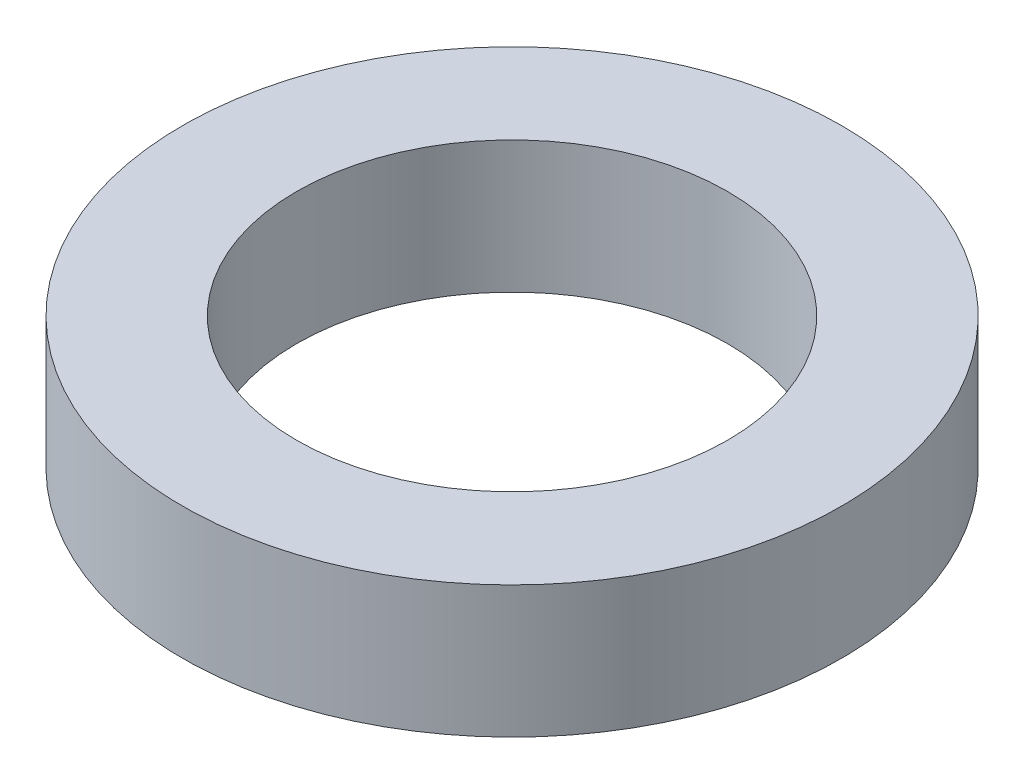
ISO-10303-21;
HEADER;
FILE_DESCRIPTION(('STEP AP214'),'2;1');
FILE_NAME('part.step','',(''),(''),'','','');
FILE_SCHEMA(('AUTOMOTIVE_DESIGN { 1 0 10303 214 1 1 1 1 }'));
ENDSEC;
DATA;
#1=APPLICATION_CONTEXT('core data for automotive mechanical design processes');
#2=APPLICATION_PROTOCOL_DEFINITION('international standard','automotive_design',2000,#1);
#3=PRODUCT_CONTEXT('',#1,'mechanical');
#4=PRODUCT('Part','Part','',(#3));
#5=PRODUCT_RELATED_PRODUCT_CATEGORY('part','',(#4));
#6=PRODUCT_DEFINITION_FORMATION('','',#4);
#7=PRODUCT_DEFINITION_CONTEXT('part definition',#1,'design');
#8=PRODUCT_DEFINITION('design','',#6,#7);
#9=PRODUCT_DEFINITION_SHAPE('','',#8);
#10=(LENGTH_UNIT() NAMED_UNIT(*) SI_UNIT(.MILLI.,.METRE.));
#11=(NAMED_UNIT(*) PLANE_ANGLE_UNIT() SI_UNIT($,.RADIAN.));
#12=(NAMED_UNIT(*) SI_UNIT($,.STERADIAN.) SOLID_ANGLE_UNIT());
#13=UNCERTAINTY_MEASURE_WITH_UNIT(LENGTH_MEASURE(1.E-05),#10,'distance_accuracy_value','');
#14=(GEOMETRIC_REPRESENTATION_CONTEXT(3) GLOBAL_UNCERTAINTY_ASSIGNED_CONTEXT((#13)) GLOBAL_UNIT_ASSIGNED_CONTEXT((#10,
#11,#12)) REPRESENTATION_CONTEXT('',''));
#15=CARTESIAN_POINT('',(0.,0.,0.));
#16=DIRECTION('',(0.,0.,1.));
#17=DIRECTION('',(1.,0.,0.));
#18=AXIS2_PLACEMENT_3D('',#15,#16,#17);
#19=CARTESIAN_POINT('',(0.,26.,0.));
#20=DIRECTION('',(0.,-1.,0.));
#21=DIRECTION('',(0.,0.,-1.));
#22=AXIS2_PLACEMENT_3D('',#19,#20,#21);
#23=CYLINDRICAL_SURFACE('',#22,65.);
#24=CARTESIAN_POINT('',(0.,26.,0.));
#25=DIRECTION('',(0.,1.,0.));
#26=DIRECTION('',(0.,0.,1.));
#27=AXIS2_PLACEMENT_3D('',#24,#25,#26);
#28=CIRCLE('',#27,65.);
#29=CARTESIAN_POINT('',(0.,26.,-65.));
#30=VERTEX_POINT('',#29);
#31=EDGE_CURVE('E10',#30,#30,#28,.T.);
#32=CARTESIAN_POINT('',(0.,0.,0.));
#33=DIRECTION('',(0.,1.,0.));
#34=DIRECTION('',(0.,0.,1.));
#35=AXIS2_PLACEMENT_3D('',#32,#33,#34);
#36=CIRCLE('',#35,65.);
#37=CARTESIAN_POINT('',(0.,0.,-65.));
#38=VERTEX_POINT('',#37);
#39=EDGE_CURVE('E37',#38,#38,#36,.T.);
#40=CARTESIAN_POINT('',(0.,26.,-65.));
#41=CARTESIAN_POINT('',(0.,25.7291666666667,-65.));
#42=CARTESIAN_POINT('',(0.,25.4583333333333,-65.));
#43=CARTESIAN_POINT('',(0.,24.9166666666667,-65.));
#44=CARTESIAN_POINT('',(0.,24.6458333333333,-65.));
#45=CARTESIAN_POINT('',(0.,24.1041666666667,-65.));
#46=CARTESIAN_POINT('',(0.,23.8333333333333,-65.));
#47=CARTESIAN_POINT('',(0.,23.2916666666667,-65.));
#48=CARTESIAN_POINT('',(0.,23.0208333333333,-65.));
#49=CARTESIAN_POINT('',(0.,22.4791666666667,-65.));
#50=CARTESIAN_POINT('',(0.,22.2083333333333,-65.));
#51=CARTESIAN_POINT('',(0.,21.6666666666667,-65.));
#52=CARTESIAN_POINT('',(0.,21.3958333333333,-65.));
#53=CARTESIAN_POINT('',(0.,20.8541666666667,-65.));
#54=CARTESIAN_POINT('',(0.,20.5833333333333,-65.));
#55=CARTESIAN_POINT('',(0.,20.0416666666667,-65.));
#56=CARTESIAN_POINT('',(0.,19.7708333333333,-65.));
#57=CARTESIAN_POINT('',(0.,19.2291666666667,-65.));
#58=CARTESIAN_POINT('',(0.,18.9583333333333,-65.));
#59=CARTESIAN_POINT('',(0.,18.4166666666667,-65.));
#60=CARTESIAN_POINT('',(0.,18.1458333333333,-65.));
#61=CARTESIAN_POINT('',(0.,17.6041666666667,-65.));
#62=CARTESIAN_POINT('',(0.,17.3333333333333,-65.));
#63=CARTESIAN_POINT('',(0.,16.7916666666667,-65.));
#64=CARTESIAN_POINT('',(0.,16.5208333333333,-65.));
#65=CARTESIAN_POINT('',(0.,15.9791666666667,-65.));
#66=CARTESIAN_POINT('',(0.,15.7083333333333,-65.));
#67=CARTESIAN_POINT('',(0.,15.1666666666667,-65.));
#68=CARTESIAN_POINT('',(0.,14.8958333333333,-65.));
#69=CARTESIAN_POINT('',(0.,14.3541666666667,-65.));
#70=CARTESIAN_POINT('',(0.,14.0833333333333,-65.));
#71=CARTESIAN_POINT('',(0.,13.5416666666667,-65.));
#72=CARTESIAN_POINT('',(0.,13.2708333333333,-65.));
#73=CARTESIAN_POINT('',(0.,12.7291666666667,-65.));
#74=CARTESIAN_POINT('',(0.,12.4583333333333,-65.));
#75=CARTESIAN_POINT('',(0.,11.9166666666667,-65.));
#76=CARTESIAN_POINT('',(0.,11.6458333333333,-65.));
#77=CARTESIAN_POINT('',(0.,11.1041666666667,-65.));
#78=CARTESIAN_POINT('',(0.,10.8333333333333,-65.));
#79=CARTESIAN_POINT('',(0.,10.2916666666667,-65.));
#80=CARTESIAN_POINT('',(0.,10.0208333333333,-65.));
#81=CARTESIAN_POINT('',(0.,9.47916666666667,-65.));
#82=CARTESIAN_POINT('',(0.,9.20833333333333,-65.));
#83=CARTESIAN_POINT('',(0.,8.66666666666667,-65.));
#84=CARTESIAN_POINT('',(0.,8.39583333333333,-65.));
#85=CARTESIAN_POINT('',(0.,7.85416666666667,-65.));
#86=CARTESIAN_POINT('',(0.,7.58333333333333,-65.));
#87=CARTESIAN_POINT('',(0.,7.04166666666667,-65.));
#88=CARTESIAN_POINT('',(0.,6.77083333333333,-65.));
#89=CARTESIAN_POINT('',(0.,6.22916666666667,-65.));
#90=CARTESIAN_POINT('',(0.,5.95833333333333,-65.));
#91=CARTESIAN_POINT('',(0.,5.41666666666667,-65.));
#92=CARTESIAN_POINT('',(0.,5.14583333333333,-65.));
#93=CARTESIAN_POINT('',(0.,4.60416666666667,-65.));
#94=CARTESIAN_POINT('',(0.,4.33333333333333,-65.));
#95=CARTESIAN_POINT('',(0.,3.79166666666667,-65.));
#96=CARTESIAN_POINT('',(0.,3.52083333333333,-65.));
#97=CARTESIAN_POINT('',(0.,2.97916666666667,-65.));
#98=CARTESIAN_POINT('',(0.,2.70833333333333,-65.));
#99=CARTESIAN_POINT('',(0.,2.16666666666667,-65.));
#100=CARTESIAN_POINT('',(0.,1.89583333333333,-65.));
#101=CARTESIAN_POINT('',(0.,1.35416666666667,-65.));
#102=CARTESIAN_POINT('',(0.,1.08333333333333,-65.));
#103=CARTESIAN_POINT('',(0.,0.541666666666667,-65.));
#104=CARTESIAN_POINT('',(0.,0.270833333333334,-65.));
#105=CARTESIAN_POINT('',(0.,0.,-65.));
#106=B_SPLINE_CURVE_WITH_KNOTS('',3,(#40,#41,#42,#43,#44,#45,#46,#47,#48,#49,#50,#51,#52,#53,
#54,#55,#56,#57,#58,#59,#60,#61,#62,#63,#64,#65,#66,#67,#68,#69,#70,#71,#72,#73,#74,#75,#76,#77,
#78,#79,#80,#81,#82,#83,#84,#85,#86,#87,#88,#89,#90,#91,#92,#93,#94,#95,#96,#97,#98,#99,#100,
#101,#102,#103,#104,#105),.UNSPECIFIED.,.F.,.F.,(4,2,2,2,2,2,2,2,2,2,2,2,2,2,2,2,2,2,2,2,2,2,2,
2,2,2,2,2,2,2,2,2,4),(0.,0.812499999999997,1.625,2.4375,3.25,4.0625,4.875,5.6875,6.5,7.3125,
8.125,8.93749999999999,9.74999999999999,10.5625,11.375,12.1875,13.,13.8125,14.625,15.4375,16.25,
17.0625,17.875,18.6875,19.5,20.3125,21.125,21.9375,22.75,23.5625,24.375,25.1875,26.),.UNSPECIFIED.);
#107=EDGE_CURVE('BSEAM40',#30,#38,#106,.T.);
#108=ORIENTED_EDGE('',*,*,#31,.F.);
#109=ORIENTED_EDGE('',*,*,#39,.T.);
#110=ORIENTED_EDGE('',*,*,#107,.T.);
#111=ORIENTED_EDGE('',*,*,#107,.F.);
#112=EDGE_LOOP('',(#108,#110,#109,#111));
#113=FACE_BOUND('',#112,.T.);
#114=ADVANCED_FACE('F40',(#113),#23,.T.);
#115=CARTESIAN_POINT('',(0.,26.,0.));
#116=DIRECTION('',(0.,1.,0.));
#117=DIRECTION('',(0.,0.,1.));
#118=AXIS2_PLACEMENT_3D('',#115,#116,#117);
#119=PLANE('',#118);
#120=CARTESIAN_POINT('',(0.,26.,0.));
#121=DIRECTION('',(0.,1.,0.));
#122=DIRECTION('',(0.,0.,1.));
#123=AXIS2_PLACEMENT_3D('',#120,#121,#122);
#124=CIRCLE('',#123,42.5);
#125=CARTESIAN_POINT('',(0.,26.,-42.5));
#126=VERTEX_POINT('',#125);
#127=EDGE_CURVE('E50',#126,#126,#124,.T.);
#128=ORIENTED_EDGE('',*,*,#127,.F.);
#129=EDGE_LOOP('',(#128));
#130=FACE_BOUND('',#129,.T.);
#131=ORIENTED_EDGE('',*,*,#31,.T.);
#132=EDGE_LOOP('',(#131));
#133=FACE_BOUND('',#132,.T.);
#134=ADVANCED_FACE('F59',(#130,#133),#119,.T.);
#135=CARTESIAN_POINT('',(0.,0.,0.));
#136=DIRECTION('',(0.,1.,0.));
#137=DIRECTION('',(0.,0.,1.));
#138=AXIS2_PLACEMENT_3D('',#135,#136,#137);
#139=PLANE('',#138);
#140=CARTESIAN_POINT('',(0.,0.,0.));
#141=DIRECTION('',(0.,1.,0.));
#142=DIRECTION('',(0.,0.,1.));
#143=AXIS2_PLACEMENT_3D('',#140,#141,#142);
#144=CIRCLE('',#143,42.5);
#145=CARTESIAN_POINT('',(0.,0.,-42.5));
#146=VERTEX_POINT('',#145);
#147=EDGE_CURVE('E47',#146,#146,#144,.T.);
#148=ORIENTED_EDGE('',*,*,#147,.T.);
#149=EDGE_LOOP('',(#148));
#150=FACE_BOUND('',#149,.T.);
#151=ORIENTED_EDGE('',*,*,#39,.F.);
#152=EDGE_LOOP('',(#151));
#153=FACE_BOUND('',#152,.T.);
#154=ADVANCED_FACE('F58',(#150,#153),#139,.F.);
#155=CARTESIAN_POINT('',(0.,26.,0.));
#156=DIRECTION('',(0.,-1.,0.));
#157=DIRECTION('',(0.,0.,-1.));
#158=AXIS2_PLACEMENT_3D('',#155,#156,#157);
#159=CYLINDRICAL_SURFACE('',#158,42.5);
#160=CARTESIAN_POINT('',(0.,26.,-42.5));
#161=CARTESIAN_POINT('',(0.,25.7291666666667,-42.5));
#162=CARTESIAN_POINT('',(0.,25.4583333333333,-42.5));
#163=CARTESIAN_POINT('',(0.,24.9166666666667,-42.5));
#164=CARTESIAN_POINT('',(0.,24.6458333333333,-42.5));
#165=CARTESIAN_POINT('',(0.,24.1041666666667,-42.5));
#166=CARTESIAN_POINT('',(0.,23.8333333333333,-42.5));
#167=CARTESIAN_POINT('',(0.,23.2916666666667,-42.5));
#168=CARTESIAN_POINT('',(0.,23.0208333333333,-42.5));
#169=CARTESIAN_POINT('',(0.,22.4791666666667,-42.5));
#170=CARTESIAN_POINT('',(0.,22.2083333333333,-42.5));
#171=CARTESIAN_POINT('',(0.,21.6666666666667,-42.5));
#172=CARTESIAN_POINT('',(0.,21.3958333333333,-42.5));
#173=CARTESIAN_POINT('',(0.,20.8541666666667,-42.5));
#174=CARTESIAN_POINT('',(0.,20.5833333333333,-42.5));
#175=CARTESIAN_POINT('',(0.,20.0416666666667,-42.5));
#176=CARTESIAN_POINT('',(0.,19.7708333333333,-42.5));
#177=CARTESIAN_POINT('',(0.,19.2291666666667,-42.5));
#178=CARTESIAN_POINT('',(0.,18.9583333333333,-42.5));
#179=CARTESIAN_POINT('',(0.,18.4166666666667,-42.5));
#180=CARTESIAN_POINT('',(0.,18.1458333333333,-42.5));
#181=CARTESIAN_POINT('',(0.,17.6041666666667,-42.5));
#182=CARTESIAN_POINT('',(0.,17.3333333333333,-42.5));
#183=CARTESIAN_POINT('',(0.,16.7916666666667,-42.5));
#184=CARTESIAN_POINT('',(0.,16.5208333333333,-42.5));
#185=CARTESIAN_POINT('',(0.,15.9791666666667,-42.5));
#186=CARTESIAN_POINT('',(0.,15.7083333333333,-42.5));
#187=CARTESIAN_POINT('',(0.,15.1666666666667,-42.5));
#188=CARTESIAN_POINT('',(0.,14.8958333333333,-42.5));
#189=CARTESIAN_POINT('',(0.,14.3541666666667,-42.5));
#190=CARTESIAN_POINT('',(0.,14.0833333333333,-42.5));
#191=CARTESIAN_POINT('',(0.,13.5416666666667,-42.5));
#192=CARTESIAN_POINT('',(0.,13.2708333333333,-42.5));
#193=CARTESIAN_POINT('',(0.,12.7291666666667,-42.5));
#194=CARTESIAN_POINT('',(0.,12.4583333333333,-42.5));
#195=CARTESIAN_POINT('',(0.,11.9166666666667,-42.5));
#196=CARTESIAN_POINT('',(0.,11.6458333333333,-42.5));
#197=CARTESIAN_POINT('',(0.,11.1041666666667,-42.5));
#198=CARTESIAN_POINT('',(0.,10.8333333333333,-42.5));
#199=CARTESIAN_POINT('',(0.,10.2916666666667,-42.5));
#200=CARTESIAN_POINT('',(0.,10.0208333333333,-42.5));
#201=CARTESIAN_POINT('',(0.,9.47916666666667,-42.5));
#202=CARTESIAN_POINT('',(0.,9.20833333333333,-42.5));
#203=CARTESIAN_POINT('',(0.,8.66666666666667,-42.5));
#204=CARTESIAN_POINT('',(0.,8.39583333333333,-42.5));
#205=CARTESIAN_POINT('',(0.,7.85416666666667,-42.5));
#206=CARTESIAN_POINT('',(0.,7.58333333333333,-42.5));
#207=CARTESIAN_POINT('',(0.,7.04166666666667,-42.5));
#208=CARTESIAN_POINT('',(0.,6.77083333333333,-42.5));
#209=CARTESIAN_POINT('',(0.,6.22916666666667,-42.5));
#210=CARTESIAN_POINT('',(0.,5.95833333333333,-42.5));
#211=CARTESIAN_POINT('',(0.,5.41666666666667,-42.5));
#212=CARTESIAN_POINT('',(0.,5.14583333333333,-42.5));
#213=CARTESIAN_POINT('',(0.,4.60416666666667,-42.5));
#214=CARTESIAN_POINT('',(0.,4.33333333333333,-42.5));
#215=CARTESIAN_POINT('',(0.,3.79166666666667,-42.5));
#216=CARTESIAN_POINT('',(0.,3.52083333333333,-42.5));
#217=CARTESIAN_POINT('',(0.,2.97916666666667,-42.5));
#218=CARTESIAN_POINT('',(0.,2.70833333333333,-42.5));
#219=CARTESIAN_POINT('',(0.,2.16666666666667,-42.5));
#220=CARTESIAN_POINT('',(0.,1.89583333333333,-42.5));
#221=CARTESIAN_POINT('',(0.,1.35416666666667,-42.5));
#222=CARTESIAN_POINT('',(0.,1.08333333333333,-42.5));
#223=CARTESIAN_POINT('',(0.,0.541666666666667,-42.5));
#224=CARTESIAN_POINT('',(0.,0.270833333333334,-42.5));
#225=CARTESIAN_POINT('',(0.,0.,-42.5));
#226=B_SPLINE_CURVE_WITH_KNOTS('',3,(#160,#161,#162,#163,#164,#165,#166,#167,#168,#169,#170,
#171,#172,#173,#174,#175,#176,#177,#178,#179,#180,#181,#182,#183,#184,#185,#186,#187,#188,#189,
#190,#191,#192,#193,#194,#195,#196,#197,#198,#199,#200,#201,#202,#203,#204,#205,#206,#207,#208,
#209,#210,#211,#212,#213,#214,#215,#216,#217,#218,#219,#220,#221,#222,#223,#224,#225),
.UNSPECIFIED.,.F.,.F.,(4,2,2,2,2,2,2,2,2,2,2,2,2,2,2,2,2,2,2,2,2,2,2,2,2,2,2,2,2,2,2,2,4),(0.,
0.812499999999997,1.625,2.4375,3.25,4.0625,4.875,5.6875,6.5,7.3125,8.125,8.93749999999999,
9.74999999999999,10.5625,11.375,12.1875,13.,13.8125,14.625,15.4375,16.25,17.0625,17.875,18.6875,
19.5,20.3125,21.125,21.9375,22.75,23.5625,24.375,25.1875,26.),.UNSPECIFIED.);
#227=EDGE_CURVE('BSEAM54',#126,#146,#226,.T.);
#228=ORIENTED_EDGE('',*,*,#127,.T.);
#229=ORIENTED_EDGE('',*,*,#147,.F.);
#230=ORIENTED_EDGE('',*,*,#227,.T.);
#231=ORIENTED_EDGE('',*,*,#227,.F.);
#232=EDGE_LOOP('',(#228,#230,#229,#231));
#233=FACE_BOUND('',#232,.T.);
#234=ADVANCED_FACE('F54',(#233),#159,.F.);
#235=CLOSED_SHELL('',(#114,#134,#154,#234));
#236=MANIFOLD_SOLID_BREP('B2',#235);
#237=ADVANCED_BREP_SHAPE_REPRESENTATION('',(#18,#236),#14);
#238=SHAPE_DEFINITION_REPRESENTATION(#9,#237);
ENDSEC;
END-ISO-10303-21;
